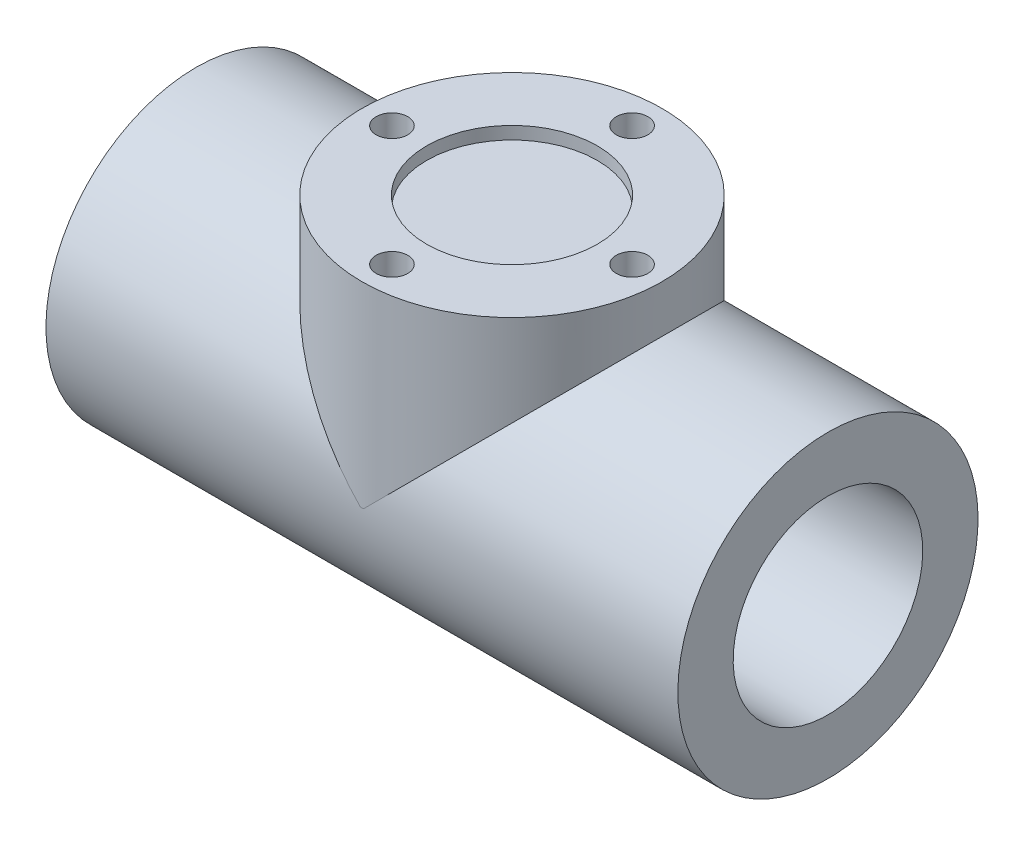
ISO-10303-21;
HEADER;
FILE_DESCRIPTION(('STEP AP214'),'2;1');
FILE_NAME('part.step','',(''),(''),'','','');
FILE_SCHEMA(('AUTOMOTIVE_DESIGN { 1 0 10303 214 1 1 1 1 }'));
ENDSEC;
DATA;
#1=APPLICATION_CONTEXT('core data for automotive mechanical design processes');
#2=APPLICATION_PROTOCOL_DEFINITION('international standard','automotive_design',2000,#1);
#3=PRODUCT_CONTEXT('',#1,'mechanical');
#4=PRODUCT('Part','Part','',(#3));
#5=PRODUCT_RELATED_PRODUCT_CATEGORY('part','',(#4));
#6=PRODUCT_DEFINITION_FORMATION('','',#4);
#7=PRODUCT_DEFINITION_CONTEXT('part definition',#1,'design');
#8=PRODUCT_DEFINITION('design','',#6,#7);
#9=PRODUCT_DEFINITION_SHAPE('','',#8);
#10=(LENGTH_UNIT() NAMED_UNIT(*) SI_UNIT(.MILLI.,.METRE.));
#11=(NAMED_UNIT(*) PLANE_ANGLE_UNIT() SI_UNIT($,.RADIAN.));
#12=(NAMED_UNIT(*) SI_UNIT($,.STERADIAN.) SOLID_ANGLE_UNIT());
#13=UNCERTAINTY_MEASURE_WITH_UNIT(LENGTH_MEASURE(1.E-05),#10,'distance_accuracy_value','');
#14=(GEOMETRIC_REPRESENTATION_CONTEXT(3) GLOBAL_UNCERTAINTY_ASSIGNED_CONTEXT((#13)) GLOBAL_UNIT_ASSIGNED_CONTEXT((#10,
#11,#12)) REPRESENTATION_CONTEXT('',''));
#15=CARTESIAN_POINT('',(0.,0.,0.));
#16=DIRECTION('',(0.,0.,1.));
#17=DIRECTION('',(1.,0.,0.));
#18=AXIS2_PLACEMENT_3D('',#15,#16,#17);
#19=CARTESIAN_POINT('',(100.,0.,0.));
#20=DIRECTION('',(1.,0.,0.));
#21=DIRECTION('',(0.,1.,0.));
#22=AXIS2_PLACEMENT_3D('',#19,#20,#21);
#23=CYLINDRICAL_SURFACE('',#22,47.5);
#24=CARTESIAN_POINT('',(-100.,0.,0.));
#25=DIRECTION('',(1.,0.,0.));
#26=DIRECTION('',(0.,1.,0.));
#27=AXIS2_PLACEMENT_3D('',#24,#25,#26);
#28=CIRCLE('',#27,47.5);
#29=CARTESIAN_POINT('',(-100.,47.5,0.));
#30=VERTEX_POINT('',#29);
#31=EDGE_CURVE('E170',#30,#30,#28,.T.);
#32=ORIENTED_EDGE('',*,*,#31,.T.);
#33=EDGE_LOOP('',(#32));
#34=FACE_BOUND('',#33,.T.);
#35=CARTESIAN_POINT('',(100.,0.,0.));
#36=DIRECTION('',(1.,0.,0.));
#37=DIRECTION('',(0.,1.,0.));
#38=AXIS2_PLACEMENT_3D('',#35,#36,#37);
#39=CIRCLE('',#38,47.5);
#40=CARTESIAN_POINT('',(100.,47.5,0.));
#41=VERTEX_POINT('',#40);
#42=EDGE_CURVE('E137',#41,#41,#39,.T.);
#43=ORIENTED_EDGE('',*,*,#42,.F.);
#44=EDGE_LOOP('',(#43));
#45=FACE_BOUND('',#44,.T.);
#46=CARTESIAN_POINT('',(0.,0.,0.));
#47=DIRECTION('',(0.707106781186548,-0.707106781186547,0.));
#48=DIRECTION('',(0.707106781186547,0.707106781186548,0.));
#49=AXIS2_PLACEMENT_3D('',#46,#47,#48);
#50=ELLIPSE('',#49,67.175144212722,47.5);
#51=CARTESIAN_POINT('',(0.500000000001985,0.500000000000001,47.4973683481517));
#52=VERTEX_POINT('',#51);
#53=CARTESIAN_POINT('',(0.500000000001985,0.500000000000001,-47.4973683481517));
#54=VERTEX_POINT('',#53);
#55=EDGE_CURVE('E61',#52,#54,#50,.F.);
#56=ORIENTED_EDGE('',*,*,#55,.F.);
#57=CARTESIAN_POINT('',(0.499999999999987,0.499999999999987,47.4973683481517));
#58=DIRECTION('',(-1.,0.,0.));
#59=VECTOR('',#58,1.);
#60=LINE('',#57,#59);
#61=CARTESIAN_POINT('',(-0.500000000001985,0.5,47.4973683481517));
#62=VERTEX_POINT('',#61);
#63=EDGE_CURVE('E11',#52,#62,#60,.T.);
#64=ORIENTED_EDGE('',*,*,#63,.T.);
#65=CARTESIAN_POINT('',(0.,0.,0.));
#66=DIRECTION('',(0.707106781186547,0.707106781186548,0.));
#67=DIRECTION('',(0.707106781186548,-0.707106781186547,0.));
#68=AXIS2_PLACEMENT_3D('',#65,#66,#67);
#69=ELLIPSE('',#68,67.175144212722,47.5);
#70=CARTESIAN_POINT('',(-0.500000000001985,0.5,-47.4973683481517));
#71=VERTEX_POINT('',#70);
#72=EDGE_CURVE('E54',#71,#62,#69,.T.);
#73=ORIENTED_EDGE('',*,*,#72,.F.);
#74=CARTESIAN_POINT('',(-0.500000000001985,0.499999999999965,-47.4973683481517));
#75=DIRECTION('',(1.,0.,0.));
#76=VECTOR('',#75,1.);
#77=LINE('',#74,#76);
#78=EDGE_CURVE('E139',#71,#54,#77,.T.);
#79=ORIENTED_EDGE('',*,*,#78,.T.);
#80=EDGE_LOOP('',(#56,#64,#73,#79));
#81=FACE_BOUND('',#80,.T.);
#82=ADVANCED_FACE('F43',(#34,#45,#81),#23,.T.);
#83=CARTESIAN_POINT('',(-100.,0.,0.));
#84=DIRECTION('',(-1.,0.,0.));
#85=DIRECTION('',(0.,-1.,0.));
#86=AXIS2_PLACEMENT_3D('',#83,#84,#85);
#87=PLANE('',#86);
#88=CARTESIAN_POINT('',(-100.,0.,0.));
#89=DIRECTION('',(1.,0.,0.));
#90=DIRECTION('',(0.,1.,0.));
#91=AXIS2_PLACEMENT_3D('',#88,#89,#90);
#92=CIRCLE('',#91,30.);
#93=CARTESIAN_POINT('',(-100.,30.,0.));
#94=VERTEX_POINT('',#93);
#95=EDGE_CURVE('E102',#94,#94,#92,.T.);
#96=ORIENTED_EDGE('',*,*,#95,.T.);
#97=EDGE_LOOP('',(#96));
#98=FACE_BOUND('',#97,.T.);
#99=ORIENTED_EDGE('',*,*,#31,.F.);
#100=EDGE_LOOP('',(#99));
#101=FACE_BOUND('',#100,.T.);
#102=ADVANCED_FACE('F45',(#98,#101),#87,.T.);
#103=CARTESIAN_POINT('',(100.,47.5,0.));
#104=DIRECTION('',(1.,0.,0.));
#105=DIRECTION('',(0.,1.,0.));
#106=AXIS2_PLACEMENT_3D('',#103,#104,#105);
#107=PLANE('',#106);
#108=CARTESIAN_POINT('',(100.,0.,0.));
#109=DIRECTION('',(1.,0.,0.));
#110=DIRECTION('',(0.,1.,0.));
#111=AXIS2_PLACEMENT_3D('',#108,#109,#110);
#112=CIRCLE('',#111,30.);
#113=CARTESIAN_POINT('',(100.,30.,0.));
#114=VERTEX_POINT('',#113);
#115=EDGE_CURVE('E223',#114,#114,#112,.T.);
#116=ORIENTED_EDGE('',*,*,#115,.F.);
#117=EDGE_LOOP('',(#116));
#118=FACE_BOUND('',#117,.T.);
#119=ORIENTED_EDGE('',*,*,#42,.T.);
#120=EDGE_LOOP('',(#119));
#121=FACE_BOUND('',#120,.T.);
#122=ADVANCED_FACE('F156',(#118,#121),#107,.T.);
#123=CARTESIAN_POINT('',(0.,0.5,0.));
#124=DIRECTION('',(0.,1.,0.));
#125=DIRECTION('',(0.,0.,1.));
#126=AXIS2_PLACEMENT_3D('',#123,#124,#125);
#127=CYLINDRICAL_SURFACE('',#126,47.5);
#128=ORIENTED_EDGE('',*,*,#78,.F.);
#129=ORIENTED_EDGE('',*,*,#72,.T.);
#130=ORIENTED_EDGE('',*,*,#63,.F.);
#131=ORIENTED_EDGE('',*,*,#55,.T.);
#132=EDGE_LOOP('',(#128,#129,#130,#131));
#133=FACE_BOUND('',#132,.T.);
#134=CARTESIAN_POINT('',(0.,62.5,0.));
#135=DIRECTION('',(0.,1.,0.));
#136=DIRECTION('',(0.,0.,1.));
#137=AXIS2_PLACEMENT_3D('',#134,#135,#136);
#138=CIRCLE('',#137,47.5);
#139=CARTESIAN_POINT('',(0.,62.5,47.5));
#140=VERTEX_POINT('',#139);
#141=EDGE_CURVE('E130',#140,#140,#138,.T.);
#142=ORIENTED_EDGE('',*,*,#141,.F.);
#143=EDGE_LOOP('',(#142));
#144=FACE_BOUND('',#143,.T.);
#145=ADVANCED_FACE('F145',(#133,#144),#127,.T.);
#146=CARTESIAN_POINT('',(0.,62.5,0.));
#147=DIRECTION('',(0.,1.,0.));
#148=DIRECTION('',(0.,0.,1.));
#149=AXIS2_PLACEMENT_3D('',#146,#147,#148);
#150=PLANE('',#149);
#151=CARTESIAN_POINT('',(38.,62.5,-3.98028872628117E-13));
#152=DIRECTION('',(0.,1.,0.));
#153=DIRECTION('',(0.,0.,1.));
#154=AXIS2_PLACEMENT_3D('',#151,#152,#153);
#155=CIRCLE('',#154,4.99999999999999);
#156=CARTESIAN_POINT('',(38.,62.5,4.99999999999959));
#157=VERTEX_POINT('',#156);
#158=EDGE_CURVE('E94',#157,#157,#155,.T.);
#159=ORIENTED_EDGE('',*,*,#158,.F.);
#160=EDGE_LOOP('',(#159));
#161=FACE_BOUND('',#160,.T.);
#162=CARTESIAN_POINT('',(0.,62.5,38.));
#163=DIRECTION('',(0.,1.,0.));
#164=DIRECTION('',(0.,0.,1.));
#165=AXIS2_PLACEMENT_3D('',#162,#163,#164);
#166=CIRCLE('',#165,4.99999999999999);
#167=CARTESIAN_POINT('',(0.,62.5,43.));
#168=VERTEX_POINT('',#167);
#169=EDGE_CURVE('E93',#168,#168,#166,.T.);
#170=ORIENTED_EDGE('',*,*,#169,.F.);
#171=EDGE_LOOP('',(#170));
#172=FACE_BOUND('',#171,.T.);
#173=CARTESIAN_POINT('',(-38.,62.5,1.32676290876039E-13));
#174=DIRECTION('',(0.,1.,0.));
#175=DIRECTION('',(0.,0.,1.));
#176=AXIS2_PLACEMENT_3D('',#173,#174,#175);
#177=CIRCLE('',#176,4.99999999999999);
#178=CARTESIAN_POINT('',(-38.,62.5,5.00000000000012));
#179=VERTEX_POINT('',#178);
#180=EDGE_CURVE('E109',#179,#179,#177,.T.);
#181=ORIENTED_EDGE('',*,*,#180,.F.);
#182=EDGE_LOOP('',(#181));
#183=FACE_BOUND('',#182,.T.);
#184=CARTESIAN_POINT('',(0.,62.5,-38.));
#185=DIRECTION('',(0.,1.,0.));
#186=DIRECTION('',(0.,0.,1.));
#187=AXIS2_PLACEMENT_3D('',#184,#185,#186);
#188=CIRCLE('',#187,4.99999999999999);
#189=CARTESIAN_POINT('',(0.,62.5,-33.));
#190=VERTEX_POINT('',#189);
#191=EDGE_CURVE('E117',#190,#190,#188,.T.);
#192=ORIENTED_EDGE('',*,*,#191,.F.);
#193=EDGE_LOOP('',(#192));
#194=FACE_BOUND('',#193,.T.);
#195=CARTESIAN_POINT('',(0.,62.5,0.));
#196=DIRECTION('',(0.,1.,0.));
#197=DIRECTION('',(0.,0.,1.));
#198=AXIS2_PLACEMENT_3D('',#195,#196,#197);
#199=CIRCLE('',#198,27.);
#200=CARTESIAN_POINT('',(0.,62.5,27.));
#201=VERTEX_POINT('',#200);
#202=EDGE_CURVE('E125',#201,#201,#199,.T.);
#203=ORIENTED_EDGE('',*,*,#202,.F.);
#204=EDGE_LOOP('',(#203));
#205=FACE_BOUND('',#204,.T.);
#206=ORIENTED_EDGE('',*,*,#141,.T.);
#207=EDGE_LOOP('',(#206));
#208=FACE_BOUND('',#207,.T.);
#209=ADVANCED_FACE('F155',(#161,#172,#183,#194,#205,#208),#150,.T.);
#210=CARTESIAN_POINT('',(0.,58.5,0.));
#211=DIRECTION('',(0.,1.,0.));
#212=DIRECTION('',(0.,0.,1.));
#213=AXIS2_PLACEMENT_3D('',#210,#211,#212);
#214=CYLINDRICAL_SURFACE('',#213,27.);
#215=CARTESIAN_POINT('',(0.,58.5,0.));
#216=DIRECTION('',(0.,1.,0.));
#217=DIRECTION('',(0.,0.,1.));
#218=AXIS2_PLACEMENT_3D('',#215,#216,#217);
#219=CIRCLE('',#218,27.);
#220=CARTESIAN_POINT('',(0.,58.5,27.));
#221=VERTEX_POINT('',#220);
#222=EDGE_CURVE('E126',#221,#221,#219,.T.);
#223=ORIENTED_EDGE('',*,*,#222,.F.);
#224=EDGE_LOOP('',(#223));
#225=FACE_BOUND('',#224,.T.);
#226=ORIENTED_EDGE('',*,*,#202,.T.);
#227=EDGE_LOOP('',(#226));
#228=FACE_BOUND('',#227,.T.);
#229=ADVANCED_FACE('F187',(#225,#228),#214,.F.);
#230=CARTESIAN_POINT('',(0.,58.5,0.));
#231=DIRECTION('',(0.,1.,0.));
#232=DIRECTION('',(0.,0.,1.));
#233=AXIS2_PLACEMENT_3D('',#230,#231,#232);
#234=PLANE('',#233);
#235=ORIENTED_EDGE('',*,*,#222,.T.);
#236=EDGE_LOOP('',(#235));
#237=FACE_BOUND('',#236,.T.);
#238=ADVANCED_FACE('F192',(#237),#234,.T.);
#239=CARTESIAN_POINT('',(0.,42.5,-38.));
#240=DIRECTION('',(0.,1.,0.));
#241=DIRECTION('',(0.,0.,1.));
#242=AXIS2_PLACEMENT_3D('',#239,#240,#241);
#243=CONICAL_SURFACE('',#242,4.99999999999998,1.02974425867665);
#244=CARTESIAN_POINT('',(0.,39.4956969048622,-38.));
#245=VERTEX_POINT('',#244);
#246=VERTEX_LOOP('',#245);
#247=FACE_BOUND('',#246,.T.);
#248=CARTESIAN_POINT('',(0.,42.5,-38.));
#249=DIRECTION('',(0.,1.,0.));
#250=DIRECTION('',(0.,0.,1.));
#251=AXIS2_PLACEMENT_3D('',#248,#249,#250);
#252=CIRCLE('',#251,4.99999999999998);
#253=CARTESIAN_POINT('',(0.,42.5,-33.));
#254=VERTEX_POINT('',#253);
#255=EDGE_CURVE('E121',#254,#254,#252,.T.);
#256=ORIENTED_EDGE('',*,*,#255,.T.);
#257=EDGE_LOOP('',(#256));
#258=FACE_BOUND('',#257,.T.);
#259=ADVANCED_FACE('F258',(#247,#258),#243,.F.);
#260=CARTESIAN_POINT('',(0.,62.5,-38.));
#261=DIRECTION('',(0.,1.,0.));
#262=DIRECTION('',(0.,0.,1.));
#263=AXIS2_PLACEMENT_3D('',#260,#261,#262);
#264=CYLINDRICAL_SURFACE('',#263,4.99999999999999);
#265=ORIENTED_EDGE('',*,*,#255,.F.);
#266=EDGE_LOOP('',(#265));
#267=FACE_BOUND('',#266,.T.);
#268=ORIENTED_EDGE('',*,*,#191,.T.);
#269=EDGE_LOOP('',(#268));
#270=FACE_BOUND('',#269,.T.);
#271=ADVANCED_FACE('F254',(#267,#270),#264,.F.);
#272=CARTESIAN_POINT('',(-38.,42.5,1.32676290876039E-13));
#273=DIRECTION('',(0.,1.,0.));
#274=DIRECTION('',(0.,0.,1.));
#275=AXIS2_PLACEMENT_3D('',#272,#273,#274);
#276=CONICAL_SURFACE('',#275,4.99999999999998,1.02974425867665);
#277=CARTESIAN_POINT('',(-38.,39.4956969048622,1.32676290876039E-13));
#278=VERTEX_POINT('',#277);
#279=VERTEX_LOOP('',#278);
#280=FACE_BOUND('',#279,.T.);
#281=CARTESIAN_POINT('',(-38.,42.5,1.32676290876039E-13));
#282=DIRECTION('',(0.,1.,0.));
#283=DIRECTION('',(0.,0.,1.));
#284=AXIS2_PLACEMENT_3D('',#281,#282,#283);
#285=CIRCLE('',#284,4.99999999999998);
#286=CARTESIAN_POINT('',(-38.,42.5,5.00000000000012));
#287=VERTEX_POINT('',#286);
#288=EDGE_CURVE('E113',#287,#287,#285,.T.);
#289=ORIENTED_EDGE('',*,*,#288,.T.);
#290=EDGE_LOOP('',(#289));
#291=FACE_BOUND('',#290,.T.);
#292=ADVANCED_FACE('F250',(#280,#291),#276,.F.);
#293=CARTESIAN_POINT('',(-38.,62.5,1.32676290876039E-13));
#294=DIRECTION('',(0.,1.,0.));
#295=DIRECTION('',(0.,0.,1.));
#296=AXIS2_PLACEMENT_3D('',#293,#294,#295);
#297=CYLINDRICAL_SURFACE('',#296,4.99999999999999);
#298=ORIENTED_EDGE('',*,*,#288,.F.);
#299=EDGE_LOOP('',(#298));
#300=FACE_BOUND('',#299,.T.);
#301=ORIENTED_EDGE('',*,*,#180,.T.);
#302=EDGE_LOOP('',(#301));
#303=FACE_BOUND('',#302,.T.);
#304=ADVANCED_FACE('F246',(#300,#303),#297,.F.);
#305=CARTESIAN_POINT('',(0.,42.5,38.));
#306=DIRECTION('',(0.,1.,0.));
#307=DIRECTION('',(0.,0.,1.));
#308=AXIS2_PLACEMENT_3D('',#305,#306,#307);
#309=CONICAL_SURFACE('',#308,4.99999999999998,1.02974425867665);
#310=CARTESIAN_POINT('',(0.,39.4956969048622,38.));
#311=VERTEX_POINT('',#310);
#312=VERTEX_LOOP('',#311);
#313=FACE_BOUND('',#312,.T.);
#314=CARTESIAN_POINT('',(0.,42.5,38.));
#315=DIRECTION('',(0.,1.,0.));
#316=DIRECTION('',(0.,0.,1.));
#317=AXIS2_PLACEMENT_3D('',#314,#315,#316);
#318=CIRCLE('',#317,4.99999999999998);
#319=CARTESIAN_POINT('',(0.,42.5,43.));
#320=VERTEX_POINT('',#319);
#321=EDGE_CURVE('E99',#320,#320,#318,.T.);
#322=ORIENTED_EDGE('',*,*,#321,.T.);
#323=EDGE_LOOP('',(#322));
#324=FACE_BOUND('',#323,.T.);
#325=ADVANCED_FACE('F242',(#313,#324),#309,.F.);
#326=CARTESIAN_POINT('',(0.,62.5,38.));
#327=DIRECTION('',(0.,1.,0.));
#328=DIRECTION('',(0.,0.,1.));
#329=AXIS2_PLACEMENT_3D('',#326,#327,#328);
#330=CYLINDRICAL_SURFACE('',#329,4.99999999999999);
#331=ORIENTED_EDGE('',*,*,#321,.F.);
#332=EDGE_LOOP('',(#331));
#333=FACE_BOUND('',#332,.T.);
#334=ORIENTED_EDGE('',*,*,#169,.T.);
#335=EDGE_LOOP('',(#334));
#336=FACE_BOUND('',#335,.T.);
#337=ADVANCED_FACE('F86',(#333,#336),#330,.F.);
#338=CARTESIAN_POINT('',(38.,42.5,-3.98028872628117E-13));
#339=DIRECTION('',(0.,1.,0.));
#340=DIRECTION('',(0.,0.,1.));
#341=AXIS2_PLACEMENT_3D('',#338,#339,#340);
#342=CONICAL_SURFACE('',#341,4.99999999999998,1.02974425867665);
#343=CARTESIAN_POINT('',(38.,39.4956969048622,-3.98028872628117E-13));
#344=VERTEX_POINT('',#343);
#345=VERTEX_LOOP('',#344);
#346=FACE_BOUND('',#345,.T.);
#347=CARTESIAN_POINT('',(38.,42.5,-3.98028872628117E-13));
#348=DIRECTION('',(0.,1.,0.));
#349=DIRECTION('',(0.,0.,1.));
#350=AXIS2_PLACEMENT_3D('',#347,#348,#349);
#351=CIRCLE('',#350,4.99999999999998);
#352=CARTESIAN_POINT('',(38.,42.5,4.99999999999959));
#353=VERTEX_POINT('',#352);
#354=EDGE_CURVE('E90',#353,#353,#351,.T.);
#355=ORIENTED_EDGE('',*,*,#354,.T.);
#356=EDGE_LOOP('',(#355));
#357=FACE_BOUND('',#356,.T.);
#358=ADVANCED_FACE('F82',(#346,#357),#342,.F.);
#359=CARTESIAN_POINT('',(38.,62.5,-3.98028872628117E-13));
#360=DIRECTION('',(0.,1.,0.));
#361=DIRECTION('',(0.,0.,1.));
#362=AXIS2_PLACEMENT_3D('',#359,#360,#361);
#363=CYLINDRICAL_SURFACE('',#362,4.99999999999999);
#364=ORIENTED_EDGE('',*,*,#354,.F.);
#365=EDGE_LOOP('',(#364));
#366=FACE_BOUND('',#365,.T.);
#367=ORIENTED_EDGE('',*,*,#158,.T.);
#368=EDGE_LOOP('',(#367));
#369=FACE_BOUND('',#368,.T.);
#370=ADVANCED_FACE('F85',(#366,#369),#363,.F.);
#371=CARTESIAN_POINT('',(-100.,0.,0.));
#372=DIRECTION('',(1.,0.,0.));
#373=DIRECTION('',(0.,1.,0.));
#374=AXIS2_PLACEMENT_3D('',#371,#372,#373);
#375=CYLINDRICAL_SURFACE('',#374,30.);
#376=ORIENTED_EDGE('',*,*,#95,.F.);
#377=EDGE_LOOP('',(#376));
#378=FACE_BOUND('',#377,.T.);
#379=ORIENTED_EDGE('',*,*,#115,.T.);
#380=EDGE_LOOP('',(#379));
#381=FACE_BOUND('',#380,.T.);
#382=ADVANCED_FACE('F232',(#378,#381),#375,.F.);
#383=CLOSED_SHELL('',(#82,#102,#122,#145,#209,#229,#238,#259,#271,#292,#304,#325,#337,#358,#370,#382));
#384=MANIFOLD_SOLID_BREP('B2',#383);
#385=ADVANCED_BREP_SHAPE_REPRESENTATION('',(#18,#384),#14);
#386=SHAPE_DEFINITION_REPRESENTATION(#9,#385);
ENDSEC;
END-ISO-10303-21;
